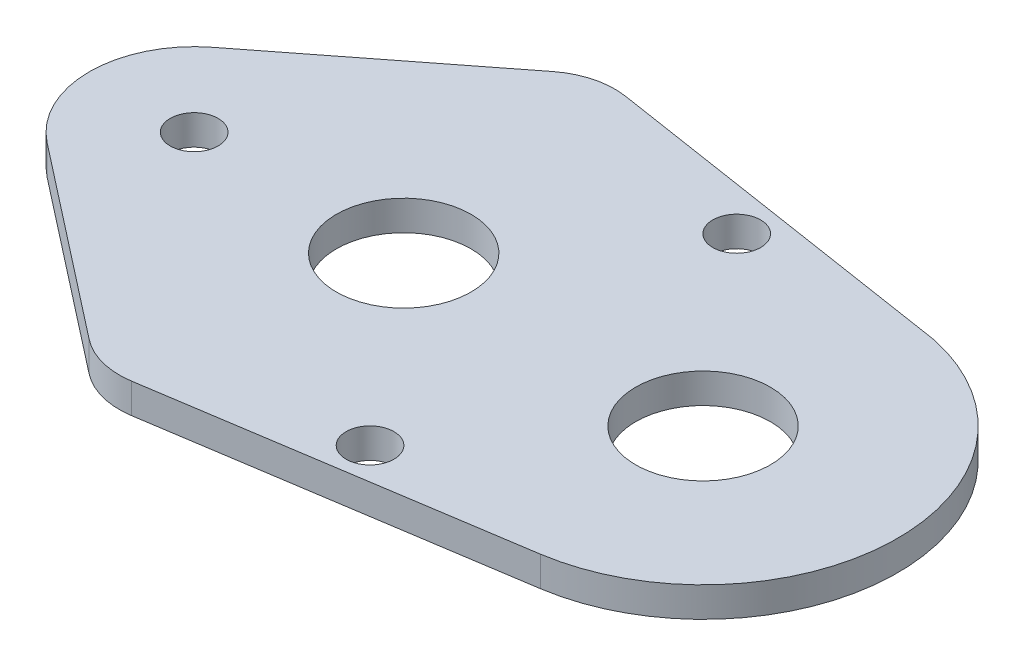
ISO-10303-21;
HEADER;
FILE_DESCRIPTION(('STEP AP214'),'2;1');
FILE_NAME('part.step','',(''),(''),'','','');
FILE_SCHEMA(('AUTOMOTIVE_DESIGN { 1 0 10303 214 1 1 1 1 }'));
ENDSEC;
DATA;
#1=APPLICATION_CONTEXT('core data for automotive mechanical design processes');
#2=APPLICATION_PROTOCOL_DEFINITION('international standard','automotive_design',2000,#1);
#3=PRODUCT_CONTEXT('',#1,'mechanical');
#4=PRODUCT('Part','Part','',(#3));
#5=PRODUCT_RELATED_PRODUCT_CATEGORY('part','',(#4));
#6=PRODUCT_DEFINITION_FORMATION('','',#4);
#7=PRODUCT_DEFINITION_CONTEXT('part definition',#1,'design');
#8=PRODUCT_DEFINITION('design','',#6,#7);
#9=PRODUCT_DEFINITION_SHAPE('','',#8);
#10=(LENGTH_UNIT() NAMED_UNIT(*) SI_UNIT(.MILLI.,.METRE.));
#11=(NAMED_UNIT(*) PLANE_ANGLE_UNIT() SI_UNIT($,.RADIAN.));
#12=(NAMED_UNIT(*) SI_UNIT($,.STERADIAN.) SOLID_ANGLE_UNIT());
#13=UNCERTAINTY_MEASURE_WITH_UNIT(LENGTH_MEASURE(1.E-05),#10,'distance_accuracy_value','');
#14=(GEOMETRIC_REPRESENTATION_CONTEXT(3) GLOBAL_UNCERTAINTY_ASSIGNED_CONTEXT((#13)) GLOBAL_UNIT_ASSIGNED_CONTEXT((#10,
#11,#12)) REPRESENTATION_CONTEXT('',''));
#15=CARTESIAN_POINT('',(0.,0.,0.));
#16=DIRECTION('',(0.,0.,1.));
#17=DIRECTION('',(1.,0.,0.));
#18=AXIS2_PLACEMENT_3D('',#15,#16,#17);
#19=CARTESIAN_POINT('',(2.76732765579161,2.,17.9645399683825));
#20=DIRECTION('',(0.152248095776488,0.,0.988342307772177));
#21=DIRECTION('',(0.988342307772177,0.,-0.152248095776488));
#22=AXIS2_PLACEMENT_3D('',#19,#20,#21);
#23=PLANE('',#22);
#24=DIRECTION('',(0.988342307772177,0.,-0.152248095776488));
#25=VECTOR('',#24,1.);
#26=CARTESIAN_POINT('',(2.76732765579161,2.,17.9645399683825));
#27=LINE('',#26,#25);
#28=CARTESIAN_POINT('',(12.3135895146823,2.,16.493996637018));
#29=VERTEX_POINT('',#28);
#30=CARTESIAN_POINT('',(35.9792252450943,2.,12.8484500010383));
#31=VERTEX_POINT('',#30);
#32=EDGE_CURVE('E167',#29,#31,#27,.T.);
#33=ORIENTED_EDGE('',*,*,#32,.F.);
#34=DIRECTION('',(0.,-1.,0.));
#35=VECTOR('',#34,1.);
#36=CARTESIAN_POINT('',(12.3135895146823,2.,16.493996637018));
#37=LINE('',#36,#35);
#38=CARTESIAN_POINT('',(12.3135895146823,0.,16.493996637018));
#39=VERTEX_POINT('',#38);
#40=EDGE_CURVE('E119',#29,#39,#37,.T.);
#41=ORIENTED_EDGE('',*,*,#40,.T.);
#42=DIRECTION('',(-0.988342307772177,0.,0.152248095776488));
#43=VECTOR('',#42,1.);
#44=CARTESIAN_POINT('',(2.76732765579161,0.,17.9645399683825));
#45=LINE('',#44,#43);
#46=CARTESIAN_POINT('',(35.9792252450944,0.,12.8484500010383));
#47=VERTEX_POINT('',#46);
#48=EDGE_CURVE('E187',#47,#39,#45,.T.);
#49=ORIENTED_EDGE('',*,*,#48,.F.);
#50=DIRECTION('',(0.,-1.,0.));
#51=VECTOR('',#50,1.);
#52=CARTESIAN_POINT('',(35.9792252450943,2.,12.8484500010383));
#53=LINE('',#52,#51);
#54=EDGE_CURVE('E47',#31,#47,#53,.T.);
#55=ORIENTED_EDGE('',*,*,#54,.F.);
#56=EDGE_LOOP('',(#33,#41,#49,#55));
#57=FACE_BOUND('',#56,.T.);
#58=ADVANCED_FACE('F40',(#57),#23,.T.);
#59=CARTESIAN_POINT('',(34.,2.,0.));
#60=DIRECTION('',(0.,-1.,0.));
#61=DIRECTION('',(0.,0.,-1.));
#62=AXIS2_PLACEMENT_3D('',#59,#60,#61);
#63=CYLINDRICAL_SURFACE('',#62,13.);
#64=DIRECTION('',(0.,-1.,0.));
#65=VECTOR('',#64,1.);
#66=CARTESIAN_POINT('',(36.8136480405111,2.,-12.6918629327663));
#67=LINE('',#66,#65);
#68=CARTESIAN_POINT('',(36.8136480405111,2.,-12.6918629327663));
#69=VERTEX_POINT('',#68);
#70=CARTESIAN_POINT('',(36.8136480405111,0.,-12.6918629327663));
#71=VERTEX_POINT('',#70);
#72=EDGE_CURVE('E140',#69,#71,#67,.T.);
#73=ORIENTED_EDGE('',*,*,#72,.F.);
#74=CARTESIAN_POINT('',(34.,2.,0.));
#75=DIRECTION('',(0.,-1.,0.));
#76=DIRECTION('',(0.,0.,-1.));
#77=AXIS2_PLACEMENT_3D('',#74,#75,#76);
#78=CIRCLE('',#77,13.);
#79=EDGE_CURVE('E206',#69,#31,#78,.T.);
#80=ORIENTED_EDGE('',*,*,#79,.T.);
#81=ORIENTED_EDGE('',*,*,#54,.T.);
#82=CARTESIAN_POINT('',(34.,0.,0.));
#83=DIRECTION('',(0.,-1.,0.));
#84=DIRECTION('',(0.,0.,-1.));
#85=AXIS2_PLACEMENT_3D('',#82,#83,#84);
#86=CIRCLE('',#85,13.);
#87=EDGE_CURVE('E132',#71,#47,#86,.T.);
#88=ORIENTED_EDGE('',*,*,#87,.F.);
#89=EDGE_LOOP('',(#73,#80,#81,#88));
#90=FACE_BOUND('',#89,.T.);
#91=ADVANCED_FACE('F159',(#90),#63,.T.);
#92=CARTESIAN_POINT('',(2.78895107485444,2.,-17.9719394377376));
#93=DIRECTION('',(-0.153348167519012,0.,0.988172221588201));
#94=DIRECTION('',(0.988172221588201,0.,0.153348167519012));
#95=AXIS2_PLACEMENT_3D('',#92,#93,#94);
#96=PLANE('',#95);
#97=DIRECTION('',(0.,-1.,0.));
#98=VECTOR('',#97,1.);
#99=CARTESIAN_POINT('',(12.3190673039404,2.,-16.4930212612838));
#100=LINE('',#99,#98);
#101=CARTESIAN_POINT('',(12.3190673039404,2.,-16.4930212612838));
#102=VERTEX_POINT('',#101);
#103=CARTESIAN_POINT('',(12.3190673039404,0.,-16.4930212612838));
#104=VERTEX_POINT('',#103);
#105=EDGE_CURVE('E138',#102,#104,#100,.T.);
#106=ORIENTED_EDGE('',*,*,#105,.F.);
#107=DIRECTION('',(0.988172221588201,0.,0.153348167519012));
#108=VECTOR('',#107,1.);
#109=CARTESIAN_POINT('',(2.78895107485444,2.,-17.9719394377376));
#110=LINE('',#109,#108);
#111=EDGE_CURVE('E149',#102,#69,#110,.T.);
#112=ORIENTED_EDGE('',*,*,#111,.T.);
#113=ORIENTED_EDGE('',*,*,#72,.T.);
#114=DIRECTION('',(0.988172221588201,0.,0.153348167519012));
#115=VECTOR('',#114,1.);
#116=CARTESIAN_POINT('',(2.78895107485444,0.,-17.9719394377376));
#117=LINE('',#116,#115);
#118=EDGE_CURVE('E148',#104,#71,#117,.T.);
#119=ORIENTED_EDGE('',*,*,#118,.F.);
#120=EDGE_LOOP('',(#106,#112,#113,#119));
#121=FACE_BOUND('',#120,.T.);
#122=ADVANCED_FACE('F147',(#121),#96,.F.);
#123=CARTESIAN_POINT('',(11.5523264663453,2.,-11.5521601533428));
#124=DIRECTION('',(0.,-1.,0.));
#125=DIRECTION('',(0.,0.,-1.));
#126=AXIS2_PLACEMENT_3D('',#123,#124,#125);
#127=CYLINDRICAL_SURFACE('',#126,5.);
#128=DIRECTION('',(0.,-1.,0.));
#129=VECTOR('',#128,1.);
#130=CARTESIAN_POINT('',(8.47622977455886,12.,-15.4939400993545));
#131=LINE('',#130,#129);
#132=CARTESIAN_POINT('',(8.47622977455886,2.,-15.4939400993545));
#133=VERTEX_POINT('',#132);
#134=CARTESIAN_POINT('',(8.47622977455885,0.,-15.4939400993545));
#135=VERTEX_POINT('',#134);
#136=EDGE_CURVE('E128',#133,#135,#131,.T.);
#137=ORIENTED_EDGE('',*,*,#136,.F.);
#138=CARTESIAN_POINT('',(11.5523264663453,2.,-11.5521601533428));
#139=DIRECTION('',(0.,-1.,0.));
#140=DIRECTION('',(0.,0.,-1.));
#141=AXIS2_PLACEMENT_3D('',#138,#139,#140);
#142=CIRCLE('',#141,5.);
#143=EDGE_CURVE('E120',#133,#102,#142,.T.);
#144=ORIENTED_EDGE('',*,*,#143,.T.);
#145=ORIENTED_EDGE('',*,*,#105,.T.);
#146=CARTESIAN_POINT('',(11.5523264663453,0.,-11.5521601533428));
#147=DIRECTION('',(0.,-1.,0.));
#148=DIRECTION('',(0.,0.,-1.));
#149=AXIS2_PLACEMENT_3D('',#146,#147,#148);
#150=CIRCLE('',#149,5.);
#151=EDGE_CURVE('E157',#135,#104,#150,.T.);
#152=ORIENTED_EDGE('',*,*,#151,.F.);
#153=EDGE_LOOP('',(#137,#144,#145,#152));
#154=FACE_BOUND('',#153,.T.);
#155=ADVANCED_FACE('F202',(#154),#127,.T.);
#156=CARTESIAN_POINT('',(11.5523490357999,2.,11.5522850981571));
#157=DIRECTION('',(0.,-1.,0.));
#158=DIRECTION('',(0.,0.,-1.));
#159=AXIS2_PLACEMENT_3D('',#156,#157,#158);
#160=CYLINDRICAL_SURFACE('',#159,5.00000000000001);
#161=ORIENTED_EDGE('',*,*,#40,.F.);
#162=CARTESIAN_POINT('',(11.5523490357999,2.,11.5522850981571));
#163=DIRECTION('',(0.,-1.,0.));
#164=DIRECTION('',(0.,0.,-1.));
#165=AXIS2_PLACEMENT_3D('',#162,#163,#164);
#166=CIRCLE('',#165,5.00000000000001);
#167=CARTESIAN_POINT('',(8.45337216873125,2.,15.4761024202777));
#168=VERTEX_POINT('',#167);
#169=EDGE_CURVE('E106',#29,#168,#166,.T.);
#170=ORIENTED_EDGE('',*,*,#169,.T.);
#171=DIRECTION('',(0.,-1.,0.));
#172=VECTOR('',#171,1.);
#173=CARTESIAN_POINT('',(8.45337216873125,12.,15.4761024202777));
#174=LINE('',#173,#172);
#175=CARTESIAN_POINT('',(8.45337216873125,0.,15.4761024202777));
#176=VERTEX_POINT('',#175);
#177=EDGE_CURVE('E117',#168,#176,#174,.T.);
#178=ORIENTED_EDGE('',*,*,#177,.T.);
#179=CARTESIAN_POINT('',(11.5523490357999,0.,11.5522850981571));
#180=DIRECTION('',(0.,-1.,0.));
#181=DIRECTION('',(0.,0.,-1.));
#182=AXIS2_PLACEMENT_3D('',#179,#180,#181);
#183=CIRCLE('',#182,5.00000000000001);
#184=EDGE_CURVE('E189',#39,#176,#183,.T.);
#185=ORIENTED_EDGE('',*,*,#184,.F.);
#186=EDGE_LOOP('',(#161,#170,#178,#185));
#187=FACE_BOUND('',#186,.T.);
#188=ADVANCED_FACE('F115',(#187),#160,.T.);
#189=CARTESIAN_POINT('',(-4.30653536850108,12.,-5.51849192441642));
#190=DIRECTION('',(-0.615219338357298,0.,-0.788355989202346));
#191=DIRECTION('',(-0.788355989202346,0.,0.615219338357298));
#192=AXIS2_PLACEMENT_3D('',#189,#190,#191);
#193=PLANE('',#192);
#194=DIRECTION('',(-0.788355989202346,0.,0.615219338357298));
#195=VECTOR('',#194,1.);
#196=CARTESIAN_POINT('',(-4.30653536850108,2.,-5.51849192441642));
#197=LINE('',#196,#195);
#198=CARTESIAN_POINT('',(-4.30653536850108,2.,-5.51849192441642));
#199=VERTEX_POINT('',#198);
#200=EDGE_CURVE('E121',#133,#199,#197,.T.);
#201=ORIENTED_EDGE('',*,*,#200,.F.);
#202=ORIENTED_EDGE('',*,*,#136,.T.);
#203=DIRECTION('',(0.788355989202346,0.,-0.615219338357298));
#204=VECTOR('',#203,1.);
#205=CARTESIAN_POINT('',(-4.30653536850108,0.,-5.51849192441642));
#206=LINE('',#205,#204);
#207=CARTESIAN_POINT('',(-4.30653536850108,0.,-5.51849192441642));
#208=VERTEX_POINT('',#207);
#209=EDGE_CURVE('E195',#208,#135,#206,.T.);
#210=ORIENTED_EDGE('',*,*,#209,.F.);
#211=DIRECTION('',(0.,-1.,0.));
#212=VECTOR('',#211,1.);
#213=CARTESIAN_POINT('',(-4.30653536850108,12.,-5.51849192441642));
#214=LINE('',#213,#212);
#215=EDGE_CURVE('E130',#199,#208,#214,.T.);
#216=ORIENTED_EDGE('',*,*,#215,.F.);
#217=EDGE_LOOP('',(#201,#202,#210,#216));
#218=FACE_BOUND('',#217,.T.);
#219=ADVANCED_FACE('F212',(#218),#193,.T.);
#220=CARTESIAN_POINT('',(0.,12.,0.));
#221=DIRECTION('',(0.,-1.,0.));
#222=DIRECTION('',(0.,0.,-1.));
#223=AXIS2_PLACEMENT_3D('',#220,#221,#222);
#224=CYLINDRICAL_SURFACE('',#223,7.);
#225=DIRECTION('',(0.,-1.,0.));
#226=VECTOR('',#225,1.);
#227=CARTESIAN_POINT('',(-4.30653536850108,12.,5.51849192441642));
#228=LINE('',#227,#226);
#229=CARTESIAN_POINT('',(-4.30653536850108,2.,5.51849192441642));
#230=VERTEX_POINT('',#229);
#231=CARTESIAN_POINT('',(-4.30653536850108,0.,5.51849192441642));
#232=VERTEX_POINT('',#231);
#233=EDGE_CURVE('E127',#230,#232,#228,.T.);
#234=ORIENTED_EDGE('',*,*,#233,.F.);
#235=CARTESIAN_POINT('',(0.,2.,0.));
#236=DIRECTION('',(0.,-1.,0.));
#237=DIRECTION('',(0.,0.,-1.));
#238=AXIS2_PLACEMENT_3D('',#235,#236,#237);
#239=CIRCLE('',#238,7.);
#240=EDGE_CURVE('E54',#230,#199,#239,.T.);
#241=ORIENTED_EDGE('',*,*,#240,.T.);
#242=ORIENTED_EDGE('',*,*,#215,.T.);
#243=CARTESIAN_POINT('',(0.,0.,0.));
#244=DIRECTION('',(0.,-1.,0.));
#245=DIRECTION('',(0.,0.,-1.));
#246=AXIS2_PLACEMENT_3D('',#243,#244,#245);
#247=CIRCLE('',#246,7.);
#248=EDGE_CURVE('E192',#232,#208,#247,.T.);
#249=ORIENTED_EDGE('',*,*,#248,.F.);
#250=EDGE_LOOP('',(#234,#241,#242,#249));
#251=FACE_BOUND('',#250,.T.);
#252=ADVANCED_FACE('F211',(#251),#224,.T.);
#253=CARTESIAN_POINT('',(-4.30653536850108,12.,5.51849192441642));
#254=DIRECTION('',(0.615219338357298,0.,-0.788355989202346));
#255=DIRECTION('',(-0.788355989202346,0.,-0.615219338357298));
#256=AXIS2_PLACEMENT_3D('',#253,#254,#255);
#257=PLANE('',#256);
#258=ORIENTED_EDGE('',*,*,#177,.F.);
#259=DIRECTION('',(-0.788355989202346,0.,-0.615219338357298));
#260=VECTOR('',#259,1.);
#261=CARTESIAN_POINT('',(-4.30653536850108,2.,5.51849192441642));
#262=LINE('',#261,#260);
#263=EDGE_CURVE('E102',#168,#230,#262,.T.);
#264=ORIENTED_EDGE('',*,*,#263,.T.);
#265=ORIENTED_EDGE('',*,*,#233,.T.);
#266=DIRECTION('',(-0.788355989202346,0.,-0.615219338357298));
#267=VECTOR('',#266,1.);
#268=CARTESIAN_POINT('',(-4.30653536850108,0.,5.51849192441642));
#269=LINE('',#268,#267);
#270=EDGE_CURVE('E126',#176,#232,#269,.T.);
#271=ORIENTED_EDGE('',*,*,#270,.F.);
#272=EDGE_LOOP('',(#258,#264,#265,#271));
#273=FACE_BOUND('',#272,.T.);
#274=ADVANCED_FACE('F124',(#273),#257,.F.);
#275=CARTESIAN_POINT('',(0.,2.,0.));
#276=DIRECTION('',(0.,-1.,0.));
#277=DIRECTION('',(0.,0.,-1.));
#278=AXIS2_PLACEMENT_3D('',#275,#276,#277);
#279=PLANE('',#278);
#280=CARTESIAN_POINT('',(0.,2.,0.));
#281=DIRECTION('',(0.,-1.,0.));
#282=DIRECTION('',(0.,0.,-1.));
#283=AXIS2_PLACEMENT_3D('',#280,#281,#282);
#284=CIRCLE('',#283,1.6);
#285=CARTESIAN_POINT('',(0.,2.,-1.6));
#286=VERTEX_POINT('',#285);
#287=EDGE_CURVE('E169',#286,#286,#284,.T.);
#288=ORIENTED_EDGE('',*,*,#287,.T.);
#289=EDGE_LOOP('',(#288));
#290=FACE_BOUND('',#289,.T.);
#291=CARTESIAN_POINT('',(34.,2.,0.));
#292=DIRECTION('',(0.,-1.,0.));
#293=DIRECTION('',(0.,0.,-1.));
#294=AXIS2_PLACEMENT_3D('',#291,#292,#293);
#295=CIRCLE('',#294,4.5);
#296=CARTESIAN_POINT('',(34.,2.,-4.5));
#297=VERTEX_POINT('',#296);
#298=EDGE_CURVE('E166',#297,#297,#295,.T.);
#299=ORIENTED_EDGE('',*,*,#298,.T.);
#300=EDGE_LOOP('',(#299));
#301=FACE_BOUND('',#300,.T.);
#302=CARTESIAN_POINT('',(14.,2.,0.));
#303=DIRECTION('',(0.,-1.,0.));
#304=DIRECTION('',(0.,0.,-1.));
#305=AXIS2_PLACEMENT_3D('',#302,#303,#304);
#306=CIRCLE('',#305,4.5);
#307=CARTESIAN_POINT('',(14.,2.,-4.5));
#308=VERTEX_POINT('',#307);
#309=EDGE_CURVE('E163',#308,#308,#306,.T.);
#310=ORIENTED_EDGE('',*,*,#309,.T.);
#311=EDGE_LOOP('',(#310));
#312=FACE_BOUND('',#311,.T.);
#313=CARTESIAN_POINT('',(24.,2.,-12.25));
#314=DIRECTION('',(0.,-1.,0.));
#315=DIRECTION('',(0.,0.,-1.));
#316=AXIS2_PLACEMENT_3D('',#313,#314,#315);
#317=CIRCLE('',#316,1.6);
#318=CARTESIAN_POINT('',(24.,2.,-13.85));
#319=VERTEX_POINT('',#318);
#320=EDGE_CURVE('E217',#319,#319,#317,.T.);
#321=ORIENTED_EDGE('',*,*,#320,.T.);
#322=EDGE_LOOP('',(#321));
#323=FACE_BOUND('',#322,.T.);
#324=ORIENTED_EDGE('',*,*,#32,.T.);
#325=ORIENTED_EDGE('',*,*,#79,.F.);
#326=ORIENTED_EDGE('',*,*,#111,.F.);
#327=ORIENTED_EDGE('',*,*,#143,.F.);
#328=ORIENTED_EDGE('',*,*,#200,.T.);
#329=ORIENTED_EDGE('',*,*,#240,.F.);
#330=ORIENTED_EDGE('',*,*,#263,.F.);
#331=ORIENTED_EDGE('',*,*,#169,.F.);
#332=EDGE_LOOP('',(#324,#325,#326,#327,#328,#329,#330,#331));
#333=FACE_BOUND('',#332,.T.);
#334=CARTESIAN_POINT('',(24.,2.,12.25));
#335=DIRECTION('',(0.,-1.,0.));
#336=DIRECTION('',(0.,0.,-1.));
#337=AXIS2_PLACEMENT_3D('',#334,#335,#336);
#338=CIRCLE('',#337,1.6);
#339=CARTESIAN_POINT('',(24.,2.,10.65));
#340=VERTEX_POINT('',#339);
#341=EDGE_CURVE('E111',#340,#340,#338,.T.);
#342=ORIENTED_EDGE('',*,*,#341,.T.);
#343=EDGE_LOOP('',(#342));
#344=FACE_BOUND('',#343,.T.);
#345=ADVANCED_FACE('F104',(#290,#301,#312,#323,#333,#344),#279,.F.);
#346=CARTESIAN_POINT('',(0.,0.,0.));
#347=DIRECTION('',(0.,1.,0.));
#348=DIRECTION('',(0.,0.,1.));
#349=AXIS2_PLACEMENT_3D('',#346,#347,#348);
#350=CYLINDRICAL_SURFACE('',#349,1.6);
#351=CARTESIAN_POINT('',(0.,0.,0.));
#352=DIRECTION('',(0.,-1.,0.));
#353=DIRECTION('',(0.,0.,-1.));
#354=AXIS2_PLACEMENT_3D('',#351,#352,#353);
#355=CIRCLE('',#354,1.6);
#356=CARTESIAN_POINT('',(0.,0.,-1.6));
#357=VERTEX_POINT('',#356);
#358=EDGE_CURVE('E180',#357,#357,#355,.T.);
#359=ORIENTED_EDGE('',*,*,#358,.T.);
#360=EDGE_LOOP('',(#359));
#361=FACE_BOUND('',#360,.T.);
#362=ORIENTED_EDGE('',*,*,#287,.F.);
#363=EDGE_LOOP('',(#362));
#364=FACE_BOUND('',#363,.T.);
#365=ADVANCED_FACE('F236',(#361,#364),#350,.F.);
#366=CARTESIAN_POINT('',(34.,0.,0.));
#367=DIRECTION('',(0.,1.,0.));
#368=DIRECTION('',(0.,0.,1.));
#369=AXIS2_PLACEMENT_3D('',#366,#367,#368);
#370=CYLINDRICAL_SURFACE('',#369,4.5);
#371=CARTESIAN_POINT('',(34.,0.,0.));
#372=DIRECTION('',(0.,-1.,0.));
#373=DIRECTION('',(0.,0.,-1.));
#374=AXIS2_PLACEMENT_3D('',#371,#372,#373);
#375=CIRCLE('',#374,4.5);
#376=CARTESIAN_POINT('',(34.,0.,-4.5));
#377=VERTEX_POINT('',#376);
#378=EDGE_CURVE('E175',#377,#377,#375,.T.);
#379=ORIENTED_EDGE('',*,*,#378,.T.);
#380=EDGE_LOOP('',(#379));
#381=FACE_BOUND('',#380,.T.);
#382=ORIENTED_EDGE('',*,*,#298,.F.);
#383=EDGE_LOOP('',(#382));
#384=FACE_BOUND('',#383,.T.);
#385=ADVANCED_FACE('F239',(#381,#384),#370,.F.);
#386=CARTESIAN_POINT('',(14.,0.,0.));
#387=DIRECTION('',(0.,1.,0.));
#388=DIRECTION('',(0.,0.,1.));
#389=AXIS2_PLACEMENT_3D('',#386,#387,#388);
#390=CYLINDRICAL_SURFACE('',#389,4.5);
#391=CARTESIAN_POINT('',(14.,0.,0.));
#392=DIRECTION('',(0.,-1.,0.));
#393=DIRECTION('',(0.,0.,-1.));
#394=AXIS2_PLACEMENT_3D('',#391,#392,#393);
#395=CIRCLE('',#394,4.5);
#396=CARTESIAN_POINT('',(14.,0.,-4.5));
#397=VERTEX_POINT('',#396);
#398=EDGE_CURVE('E171',#397,#397,#395,.T.);
#399=ORIENTED_EDGE('',*,*,#398,.T.);
#400=EDGE_LOOP('',(#399));
#401=FACE_BOUND('',#400,.T.);
#402=ORIENTED_EDGE('',*,*,#309,.F.);
#403=EDGE_LOOP('',(#402));
#404=FACE_BOUND('',#403,.T.);
#405=ADVANCED_FACE('F228',(#401,#404),#390,.F.);
#406=CARTESIAN_POINT('',(0.,0.,0.));
#407=DIRECTION('',(0.,-1.,0.));
#408=DIRECTION('',(0.,0.,-1.));
#409=AXIS2_PLACEMENT_3D('',#406,#407,#408);
#410=PLANE('',#409);
#411=CARTESIAN_POINT('',(24.,0.,12.25));
#412=DIRECTION('',(0.,-1.,0.));
#413=DIRECTION('',(0.,0.,-1.));
#414=AXIS2_PLACEMENT_3D('',#411,#412,#413);
#415=CIRCLE('',#414,1.6);
#416=CARTESIAN_POINT('',(24.,0.,10.65));
#417=VERTEX_POINT('',#416);
#418=EDGE_CURVE('E11',#417,#417,#415,.T.);
#419=ORIENTED_EDGE('',*,*,#418,.F.);
#420=EDGE_LOOP('',(#419));
#421=FACE_BOUND('',#420,.T.);
#422=CARTESIAN_POINT('',(24.,0.,-12.25));
#423=DIRECTION('',(0.,-1.,0.));
#424=DIRECTION('',(0.,0.,-1.));
#425=AXIS2_PLACEMENT_3D('',#422,#423,#424);
#426=CIRCLE('',#425,1.6);
#427=CARTESIAN_POINT('',(24.,0.,-13.85));
#428=VERTEX_POINT('',#427);
#429=EDGE_CURVE('E220',#428,#428,#426,.T.);
#430=ORIENTED_EDGE('',*,*,#429,.F.);
#431=EDGE_LOOP('',(#430));
#432=FACE_BOUND('',#431,.T.);
#433=ORIENTED_EDGE('',*,*,#398,.F.);
#434=EDGE_LOOP('',(#433));
#435=FACE_BOUND('',#434,.T.);
#436=ORIENTED_EDGE('',*,*,#378,.F.);
#437=EDGE_LOOP('',(#436));
#438=FACE_BOUND('',#437,.T.);
#439=ORIENTED_EDGE('',*,*,#358,.F.);
#440=EDGE_LOOP('',(#439));
#441=FACE_BOUND('',#440,.T.);
#442=ORIENTED_EDGE('',*,*,#48,.T.);
#443=ORIENTED_EDGE('',*,*,#184,.T.);
#444=ORIENTED_EDGE('',*,*,#270,.T.);
#445=ORIENTED_EDGE('',*,*,#248,.T.);
#446=ORIENTED_EDGE('',*,*,#209,.T.);
#447=ORIENTED_EDGE('',*,*,#151,.T.);
#448=ORIENTED_EDGE('',*,*,#118,.T.);
#449=ORIENTED_EDGE('',*,*,#87,.T.);
#450=EDGE_LOOP('',(#442,#443,#444,#445,#446,#447,#448,#449));
#451=FACE_BOUND('',#450,.T.);
#452=ADVANCED_FACE('F153',(#421,#432,#435,#438,#441,#451),#410,.T.);
#453=CARTESIAN_POINT('',(24.,10.,-12.25));
#454=DIRECTION('',(0.,-1.,0.));
#455=DIRECTION('',(0.,0.,-1.));
#456=AXIS2_PLACEMENT_3D('',#453,#454,#455);
#457=CYLINDRICAL_SURFACE('',#456,1.6);
#458=ORIENTED_EDGE('',*,*,#320,.F.);
#459=EDGE_LOOP('',(#458));
#460=FACE_BOUND('',#459,.T.);
#461=ORIENTED_EDGE('',*,*,#429,.T.);
#462=EDGE_LOOP('',(#461));
#463=FACE_BOUND('',#462,.T.);
#464=ADVANCED_FACE('F224',(#460,#463),#457,.F.);
#465=CARTESIAN_POINT('',(24.,10.,12.25));
#466=DIRECTION('',(0.,-1.,0.));
#467=DIRECTION('',(0.,0.,-1.));
#468=AXIS2_PLACEMENT_3D('',#465,#466,#467);
#469=CYLINDRICAL_SURFACE('',#468,1.6);
#470=ORIENTED_EDGE('',*,*,#341,.F.);
#471=EDGE_LOOP('',(#470));
#472=FACE_BOUND('',#471,.T.);
#473=ORIENTED_EDGE('',*,*,#418,.T.);
#474=EDGE_LOOP('',(#473));
#475=FACE_BOUND('',#474,.T.);
#476=ADVANCED_FACE('F277',(#472,#475),#469,.F.);
#477=CLOSED_SHELL('',(#58,#91,#122,#155,#188,#219,#252,#274,#345,#365,#385,#405,#452,#464,#476));
#478=MANIFOLD_SOLID_BREP('B2',#477);
#479=ADVANCED_BREP_SHAPE_REPRESENTATION('',(#18,#478),#14);
#480=SHAPE_DEFINITION_REPRESENTATION(#9,#479);
ENDSEC;
END-ISO-10303-21;
